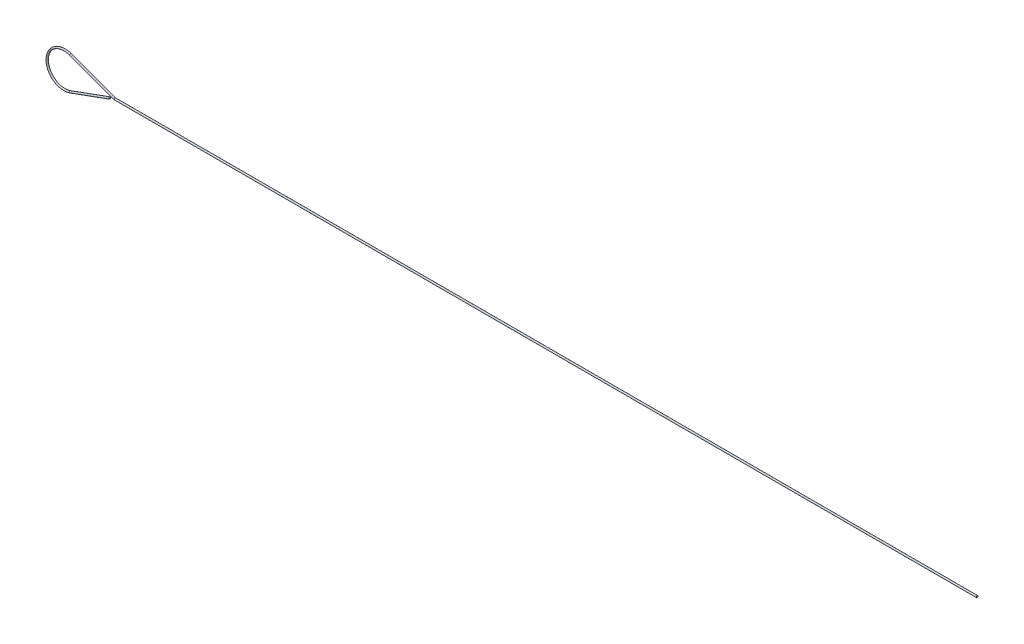
ISO-10303-21;
HEADER;
FILE_DESCRIPTION(('STEP AP214'),'2;1');
FILE_NAME('part.step','',(''),(''),'','','');
FILE_SCHEMA(('AUTOMOTIVE_DESIGN { 1 0 10303 214 1 1 1 1 }'));
ENDSEC;
DATA;
#1=APPLICATION_CONTEXT('core data for automotive mechanical design processes');
#2=APPLICATION_PROTOCOL_DEFINITION('international standard','automotive_design',2000,#1);
#3=PRODUCT_CONTEXT('',#1,'mechanical');
#4=PRODUCT('Part','Part','',(#3));
#5=PRODUCT_RELATED_PRODUCT_CATEGORY('part','',(#4));
#6=PRODUCT_DEFINITION_FORMATION('','',#4);
#7=PRODUCT_DEFINITION_CONTEXT('part definition',#1,'design');
#8=PRODUCT_DEFINITION('design','',#6,#7);
#9=PRODUCT_DEFINITION_SHAPE('','',#8);
#10=(LENGTH_UNIT() NAMED_UNIT(*) SI_UNIT(.MILLI.,.METRE.));
#11=(NAMED_UNIT(*) PLANE_ANGLE_UNIT() SI_UNIT($,.RADIAN.));
#12=(NAMED_UNIT(*) SI_UNIT($,.STERADIAN.) SOLID_ANGLE_UNIT());
#13=UNCERTAINTY_MEASURE_WITH_UNIT(LENGTH_MEASURE(1.E-05),#10,'distance_accuracy_value','');
#14=(GEOMETRIC_REPRESENTATION_CONTEXT(3) GLOBAL_UNCERTAINTY_ASSIGNED_CONTEXT((#13)) GLOBAL_UNIT_ASSIGNED_CONTEXT((#10,
#11,#12)) REPRESENTATION_CONTEXT('',''));
#15=CARTESIAN_POINT('',(0.,0.,0.));
#16=DIRECTION('',(0.,0.,1.));
#17=DIRECTION('',(1.,0.,0.));
#18=AXIS2_PLACEMENT_3D('',#15,#16,#17);
#19=CARTESIAN_POINT('',(3.42020143325676,-9.39692620785906,0.));
#20=DIRECTION('',(0.93969262078591,0.342020143325663,0.));
#21=DIRECTION('',(-0.342020143325663,0.939692620785911,0.));
#22=AXIS2_PLACEMENT_3D('',#19,#20,#21);
#23=CYLINDRICAL_SURFACE('',#22,0.5);
#24=CARTESIAN_POINT('',(3.42020143325676,-9.39692620785906,0.));
#25=DIRECTION('',(0.939692620785905,0.342020143325677,0.));
#26=DIRECTION('',(-0.342020143325677,0.939692620785906,0.));
#27=AXIS2_PLACEMENT_3D('',#24,#25,#26);
#28=CIRCLE('',#27,0.5);
#29=CARTESIAN_POINT('',(3.5912115049196,-9.86677251825201,0.));
#30=VERTEX_POINT('',#29);
#31=EDGE_CURVE('E40',#30,#30,#28,.T.);
#32=ORIENTED_EDGE('',*,*,#31,.T.);
#33=EDGE_LOOP('',(#32));
#34=FACE_BOUND('',#33,.T.);
#35=CARTESIAN_POINT('',(26.3410263430952,-1.05442819585072,0.));
#36=DIRECTION('',(0.939692620785905,0.342020143325677,0.));
#37=DIRECTION('',(-0.342020143325677,0.939692620785906,0.));
#38=AXIS2_PLACEMENT_3D('',#35,#36,#37);
#39=CIRCLE('',#38,0.5);
#40=CARTESIAN_POINT('',(26.1700162714324,-0.584581885457763,0.));
#41=VERTEX_POINT('',#40);
#42=EDGE_CURVE('E11',#41,#41,#39,.T.);
#43=ORIENTED_EDGE('',*,*,#42,.F.);
#44=EDGE_LOOP('',(#43));
#45=FACE_BOUND('',#44,.T.);
#46=ADVANCED_FACE('F34',(#34,#45),#23,.T.);
#47=CARTESIAN_POINT('',(0.,0.,0.));
#48=DIRECTION('',(0.,0.,1.));
#49=DIRECTION('',(1.,0.,0.));
#50=AXIS2_PLACEMENT_3D('',#47,#48,#49);
#51=TOROIDAL_SURFACE('',#50,10.,0.5);
#52=CARTESIAN_POINT('',(3.42020143325663,9.3969262078591,0.));
#53=DIRECTION('',(-0.939692620785911,0.342020143325662,0.));
#54=DIRECTION('',(-0.342020143325662,-0.939692620785911,0.));
#55=AXIS2_PLACEMENT_3D('',#52,#53,#54);
#56=CIRCLE('',#55,0.5);
#57=CARTESIAN_POINT('',(3.59121150491946,9.86677251825206,0.));
#58=VERTEX_POINT('',#57);
#59=EDGE_CURVE('E44',#58,#58,#56,.T.);
#60=CARTESIAN_POINT('',(0.,0.,0.));
#61=DIRECTION('',(0.,0.,1.));
#62=DIRECTION('',(1.,0.,0.));
#63=AXIS2_PLACEMENT_3D('',#60,#61,#62);
#64=CIRCLE('',#63,10.5);
#65=EDGE_CURVE('',#58,#30,#64,.T.);
#66=ORIENTED_EDGE('',*,*,#59,.T.);
#67=ORIENTED_EDGE('',*,*,#31,.F.);
#68=ORIENTED_EDGE('',*,*,#65,.T.);
#69=ORIENTED_EDGE('',*,*,#65,.F.);
#70=EDGE_LOOP('',(#66,#68,#67,#69));
#71=FACE_BOUND('',#70,.T.);
#72=ADVANCED_FACE('F69',(#71),#51,.T.);
#73=CARTESIAN_POINT('',(29.2380440016314,0.,0.));
#74=DIRECTION('',(-0.939692620785911,0.342020143325663,0.));
#75=DIRECTION('',(-0.342020143325663,-0.939692620785911,0.));
#76=AXIS2_PLACEMENT_3D('',#73,#74,#75);
#77=CYLINDRICAL_SURFACE('',#76,0.5);
#78=CARTESIAN_POINT('',(29.2380440016314,0.,0.));
#79=DIRECTION('',(-0.984807753012209,0.173648177666927,0.));
#80=DIRECTION('',(0.173648177666927,0.984807753012209,0.));
#81=AXIS2_PLACEMENT_3D('',#78,#79,#80);
#82=ELLIPSE('',#81,0.507713305942872,0.5);
#83=CARTESIAN_POINT('',(29.3262074919856,0.5,0.));
#84=VERTEX_POINT('',#83);
#85=EDGE_CURVE('E48',#84,#84,#82,.F.);
#86=ORIENTED_EDGE('',*,*,#85,.F.);
#87=EDGE_LOOP('',(#86));
#88=FACE_BOUND('',#87,.T.);
#89=ORIENTED_EDGE('',*,*,#59,.F.);
#90=EDGE_LOOP('',(#89));
#91=FACE_BOUND('',#90,.T.);
#92=ADVANCED_FACE('F66',(#88,#91),#77,.T.);
#93=CARTESIAN_POINT('',(529.238044001631,0.,0.));
#94=DIRECTION('',(1.,0.,0.));
#95=DIRECTION('',(0.,0.,-1.));
#96=AXIS2_PLACEMENT_3D('',#93,#94,#95);
#97=PLANE('',#96);
#98=CARTESIAN_POINT('',(529.238044001631,0.,0.));
#99=DIRECTION('',(1.,0.,0.));
#100=DIRECTION('',(0.,0.,-1.));
#101=AXIS2_PLACEMENT_3D('',#98,#99,#100);
#102=CIRCLE('',#101,0.5);
#103=CARTESIAN_POINT('',(529.238044001631,0.,-0.5));
#104=VERTEX_POINT('',#103);
#105=EDGE_CURVE('E53',#104,#104,#102,.T.);
#106=ORIENTED_EDGE('',*,*,#105,.T.);
#107=EDGE_LOOP('',(#106));
#108=FACE_BOUND('',#107,.T.);
#109=ADVANCED_FACE('F57',(#108),#97,.T.);
#110=CARTESIAN_POINT('',(27.8238304392583,0.,0.));
#111=DIRECTION('',(1.,0.,0.));
#112=DIRECTION('',(0.,1.,0.));
#113=AXIS2_PLACEMENT_3D('',#110,#111,#112);
#114=CYLINDRICAL_SURFACE('',#113,0.5);
#115=ORIENTED_EDGE('',*,*,#105,.F.);
#116=EDGE_LOOP('',(#115));
#117=FACE_BOUND('',#116,.T.);
#118=ORIENTED_EDGE('',*,*,#85,.T.);
#119=EDGE_LOOP('',(#118));
#120=FACE_BOUND('',#119,.T.);
#121=ADVANCED_FACE('F59',(#117,#120),#114,.T.);
#122=CARTESIAN_POINT('',(26.3410263430952,-1.05442819585072,0.));
#123=DIRECTION('',(0.939692620785905,0.342020143325677,0.));
#124=DIRECTION('',(-0.342020143325677,0.939692620785906,0.));
#125=AXIS2_PLACEMENT_3D('',#122,#123,#124);
#126=PLANE('',#125);
#127=ORIENTED_EDGE('',*,*,#42,.T.);
#128=EDGE_LOOP('',(#127));
#129=FACE_BOUND('',#128,.T.);
#130=ADVANCED_FACE('F62',(#129),#126,.T.);
#131=CLOSED_SHELL('',(#46,#72,#92,#109,#121,#130));
#132=MANIFOLD_SOLID_BREP('B2',#131);
#133=ADVANCED_BREP_SHAPE_REPRESENTATION('',(#18,#132),#14);
#134=SHAPE_DEFINITION_REPRESENTATION(#9,#133);
ENDSEC;
END-ISO-10303-21;
